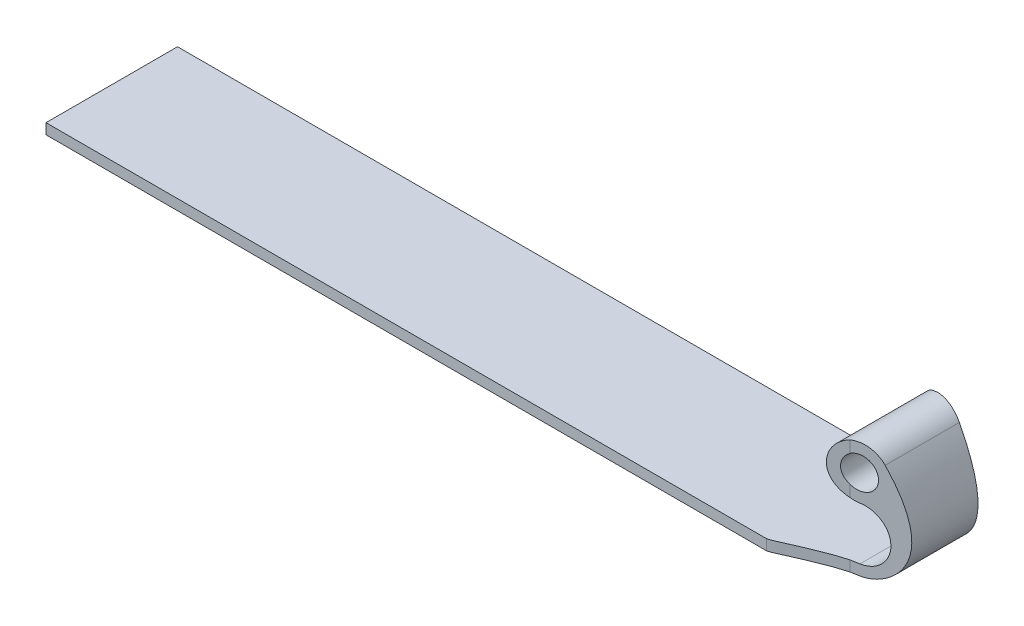
ISO-10303-21;
HEADER;
FILE_DESCRIPTION(('STEP AP214'),'2;1');
FILE_NAME('part.step','',(''),(''),'','','');
FILE_SCHEMA(('AUTOMOTIVE_DESIGN { 1 0 10303 214 1 1 1 1 }'));
ENDSEC;
DATA;
#1=APPLICATION_CONTEXT('core data for automotive mechanical design processes');
#2=APPLICATION_PROTOCOL_DEFINITION('international standard','automotive_design',2000,#1);
#3=PRODUCT_CONTEXT('',#1,'mechanical');
#4=PRODUCT('Part','Part','',(#3));
#5=PRODUCT_RELATED_PRODUCT_CATEGORY('part','',(#4));
#6=PRODUCT_DEFINITION_FORMATION('','',#4);
#7=PRODUCT_DEFINITION_CONTEXT('part definition',#1,'design');
#8=PRODUCT_DEFINITION('design','',#6,#7);
#9=PRODUCT_DEFINITION_SHAPE('','',#8);
#10=(LENGTH_UNIT() NAMED_UNIT(*) SI_UNIT(.MILLI.,.METRE.));
#11=(NAMED_UNIT(*) PLANE_ANGLE_UNIT() SI_UNIT($,.RADIAN.));
#12=(NAMED_UNIT(*) SI_UNIT($,.STERADIAN.) SOLID_ANGLE_UNIT());
#13=UNCERTAINTY_MEASURE_WITH_UNIT(LENGTH_MEASURE(1.E-05),#10,'distance_accuracy_value','');
#14=(GEOMETRIC_REPRESENTATION_CONTEXT(3) GLOBAL_UNCERTAINTY_ASSIGNED_CONTEXT((#13)) GLOBAL_UNIT_ASSIGNED_CONTEXT((#10,
#11,#12)) REPRESENTATION_CONTEXT('',''));
#15=CARTESIAN_POINT('',(0.,0.,0.));
#16=DIRECTION('',(0.,0.,1.));
#17=DIRECTION('',(1.,0.,0.));
#18=AXIS2_PLACEMENT_3D('',#15,#16,#17);
#19=CARTESIAN_POINT('',(-38.1,1.016,-6.35));
#20=DIRECTION('',(0.,0.,1.));
#21=DIRECTION('',(1.,0.,0.));
#22=AXIS2_PLACEMENT_3D('',#19,#20,#21);
#23=PLANE('',#22);
#24=DIRECTION('',(0.,1.,0.));
#25=VECTOR('',#24,1.);
#26=CARTESIAN_POINT('',(31.4618728230442,-8.984,-6.35));
#27=LINE('',#26,#25);
#28=CARTESIAN_POINT('',(31.4618728230442,0.,-6.35));
#29=VERTEX_POINT('',#28);
#30=CARTESIAN_POINT('',(31.4618728230442,1.016,-6.35));
#31=VERTEX_POINT('',#30);
#32=EDGE_CURVE('E217',#29,#31,#27,.T.);
#33=ORIENTED_EDGE('',*,*,#32,.F.);
#34=DIRECTION('',(-1.,0.,0.));
#35=VECTOR('',#34,1.);
#36=CARTESIAN_POINT('',(-38.1,0.,-6.35));
#37=LINE('',#36,#35);
#38=CARTESIAN_POINT('',(-38.1,0.,-6.35));
#39=VERTEX_POINT('',#38);
#40=EDGE_CURVE('E231',#29,#39,#37,.T.);
#41=ORIENTED_EDGE('',*,*,#40,.T.);
#42=DIRECTION('',(0.,-1.,0.));
#43=VECTOR('',#42,1.);
#44=CARTESIAN_POINT('',(-38.1,1.016,-6.35));
#45=LINE('',#44,#43);
#46=CARTESIAN_POINT('',(-38.1,1.016,-6.35));
#47=VERTEX_POINT('',#46);
#48=EDGE_CURVE('E260',#47,#39,#45,.T.);
#49=ORIENTED_EDGE('',*,*,#48,.F.);
#50=DIRECTION('',(-1.,0.,0.));
#51=VECTOR('',#50,1.);
#52=CARTESIAN_POINT('',(-38.1,1.016,-6.35));
#53=LINE('',#52,#51);
#54=EDGE_CURVE('E245',#31,#47,#53,.T.);
#55=ORIENTED_EDGE('',*,*,#54,.F.);
#56=EDGE_LOOP('',(#33,#41,#49,#55));
#57=FACE_BOUND('',#56,.T.);
#58=ADVANCED_FACE('F32',(#57),#23,.F.);
#59=CARTESIAN_POINT('',(0.,1.016,0.));
#60=DIRECTION('',(0.,-1.,0.));
#61=DIRECTION('',(0.,0.,-1.));
#62=AXIS2_PLACEMENT_3D('',#59,#60,#61);
#63=PLANE('',#62);
#64=CARTESIAN_POINT('',(39.2056630331056,1.016,-3.75211753897652));
#65=CARTESIAN_POINT('',(36.3576672367003,1.016,-3.87614198539521));
#66=CARTESIAN_POINT('',(31.9938209662141,1.016,-6.35));
#67=CARTESIAN_POINT('',(31.4618728230442,1.016,-6.35));
#68=B_SPLINE_CURVE_WITH_KNOTS('',3,(#64,#65,#66,#67),.UNSPECIFIED.,.F.,.F.,(4,4),(0.,1.),.UNSPECIFIED.);
#69=CARTESIAN_POINT('',(37.2738999237345,1.016,-4.09273949549593));
#70=VERTEX_POINT('',#69);
#71=EDGE_CURVE('E234',#31,#70,#68,.F.);
#72=ORIENTED_EDGE('',*,*,#71,.F.);
#73=ORIENTED_EDGE('',*,*,#54,.T.);
#74=DIRECTION('',(0.,0.,1.));
#75=VECTOR('',#74,1.);
#76=CARTESIAN_POINT('',(-38.1,1.016,6.35));
#77=LINE('',#76,#75);
#78=CARTESIAN_POINT('',(-38.1,1.016,6.35));
#79=VERTEX_POINT('',#78);
#80=EDGE_CURVE('E248',#47,#79,#77,.T.);
#81=ORIENTED_EDGE('',*,*,#80,.T.);
#82=DIRECTION('',(1.,0.,0.));
#83=VECTOR('',#82,1.);
#84=CARTESIAN_POINT('',(-38.1,1.016,6.35));
#85=LINE('',#84,#83);
#86=CARTESIAN_POINT('',(31.4618728230442,1.016,6.35));
#87=VERTEX_POINT('',#86);
#88=EDGE_CURVE('E250',#79,#87,#85,.T.);
#89=ORIENTED_EDGE('',*,*,#88,.T.);
#90=CARTESIAN_POINT('',(39.2056630331056,1.016,3.75211753897652));
#91=CARTESIAN_POINT('',(36.3576672367003,1.016,3.87614198539521));
#92=CARTESIAN_POINT('',(31.9938209662141,1.016,6.35));
#93=CARTESIAN_POINT('',(31.4618728230442,1.016,6.35));
#94=B_SPLINE_CURVE_WITH_KNOTS('',3,(#90,#91,#92,#93),.UNSPECIFIED.,.F.,.F.,(4,4),(0.,1.),.UNSPECIFIED.);
#95=CARTESIAN_POINT('',(37.2738999237345,1.016,4.09273949549593));
#96=VERTEX_POINT('',#95);
#97=EDGE_CURVE('E149',#87,#96,#94,.F.);
#98=ORIENTED_EDGE('',*,*,#97,.T.);
#99=DIRECTION('',(-0.984807753012208,0.,0.173648177666931));
#100=VECTOR('',#99,1.);
#101=CARTESIAN_POINT('',(1.82384528316646,1.016,10.3435405962174));
#102=LINE('',#101,#100);
#103=CARTESIAN_POINT('',(38.1,1.016,3.94707576328499));
#104=VERTEX_POINT('',#103);
#105=EDGE_CURVE('E156',#104,#96,#102,.T.);
#106=ORIENTED_EDGE('',*,*,#105,.F.);
#107=DIRECTION('',(0.,0.,-1.));
#108=VECTOR('',#107,1.);
#109=CARTESIAN_POINT('',(38.1,1.016,6.35));
#110=LINE('',#109,#108);
#111=CARTESIAN_POINT('',(38.1,1.016,-3.94707576328499));
#112=VERTEX_POINT('',#111);
#113=EDGE_CURVE('E242',#104,#112,#110,.T.);
#114=ORIENTED_EDGE('',*,*,#113,.T.);
#115=DIRECTION('',(-0.984807753012208,0.,-0.173648177666931));
#116=VECTOR('',#115,1.);
#117=CARTESIAN_POINT('',(1.82384528316646,1.016,-10.3435405962174));
#118=LINE('',#117,#116);
#119=EDGE_CURVE('E289',#112,#70,#118,.T.);
#120=ORIENTED_EDGE('',*,*,#119,.T.);
#121=EDGE_LOOP('',(#72,#73,#81,#89,#98,#106,#114,#120));
#122=FACE_BOUND('',#121,.T.);
#123=ADVANCED_FACE('F300',(#122),#63,.F.);
#124=CARTESIAN_POINT('',(0.,0.,0.));
#125=DIRECTION('',(0.,-1.,0.));
#126=DIRECTION('',(0.,0.,-1.));
#127=AXIS2_PLACEMENT_3D('',#124,#125,#126);
#128=PLANE('',#127);
#129=ORIENTED_EDGE('',*,*,#40,.F.);
#130=CARTESIAN_POINT('',(39.2056630331056,0.,-3.75211753897652));
#131=CARTESIAN_POINT('',(36.3576672367003,0.,-3.87614198539521));
#132=CARTESIAN_POINT('',(31.9938209662141,0.,-6.35));
#133=CARTESIAN_POINT('',(31.4618728230442,0.,-6.35));
#134=B_SPLINE_CURVE_WITH_KNOTS('',3,(#130,#131,#132,#133),.UNSPECIFIED.,.F.,.F.,(4,4),(0.,1.),.UNSPECIFIED.);
#135=CARTESIAN_POINT('',(37.2738999237345,0.,-4.09273949549593));
#136=VERTEX_POINT('',#135);
#137=EDGE_CURVE('E315',#29,#136,#134,.F.);
#138=ORIENTED_EDGE('',*,*,#137,.T.);
#139=DIRECTION('',(-0.984807753012208,0.,-0.173648177666931));
#140=VECTOR('',#139,1.);
#141=CARTESIAN_POINT('',(1.82384528316646,0.,-10.3435405962174));
#142=LINE('',#141,#140);
#143=CARTESIAN_POINT('',(38.1,0.,-3.94707576328499));
#144=VERTEX_POINT('',#143);
#145=EDGE_CURVE('E287',#144,#136,#142,.T.);
#146=ORIENTED_EDGE('',*,*,#145,.F.);
#147=DIRECTION('',(0.,0.,-1.));
#148=VECTOR('',#147,1.);
#149=CARTESIAN_POINT('',(38.1,0.,6.35));
#150=LINE('',#149,#148);
#151=CARTESIAN_POINT('',(38.1,0.,3.94707576328499));
#152=VERTEX_POINT('',#151);
#153=EDGE_CURVE('E164',#152,#144,#150,.T.);
#154=ORIENTED_EDGE('',*,*,#153,.F.);
#155=DIRECTION('',(-0.984807753012208,0.,0.173648177666931));
#156=VECTOR('',#155,1.);
#157=CARTESIAN_POINT('',(1.82384528316646,0.,10.3435405962174));
#158=LINE('',#157,#156);
#159=CARTESIAN_POINT('',(37.2738999237345,0.,4.09273949549593));
#160=VERTEX_POINT('',#159);
#161=EDGE_CURVE('E153',#152,#160,#158,.T.);
#162=ORIENTED_EDGE('',*,*,#161,.T.);
#163=CARTESIAN_POINT('',(39.2056630331056,0.,3.75211753897652));
#164=CARTESIAN_POINT('',(36.3576672367003,0.,3.87614198539521));
#165=CARTESIAN_POINT('',(31.9938209662141,0.,6.35));
#166=CARTESIAN_POINT('',(31.4618728230442,0.,6.35));
#167=B_SPLINE_CURVE_WITH_KNOTS('',3,(#163,#164,#165,#166),.UNSPECIFIED.,.F.,.F.,(4,4),(0.,1.),.UNSPECIFIED.);
#168=CARTESIAN_POINT('',(31.4618728230442,0.,6.35));
#169=VERTEX_POINT('',#168);
#170=EDGE_CURVE('E138',#169,#160,#167,.F.);
#171=ORIENTED_EDGE('',*,*,#170,.F.);
#172=DIRECTION('',(1.,0.,0.));
#173=VECTOR('',#172,1.);
#174=CARTESIAN_POINT('',(-38.1,0.,6.35));
#175=LINE('',#174,#173);
#176=CARTESIAN_POINT('',(-38.1,0.,6.35));
#177=VERTEX_POINT('',#176);
#178=EDGE_CURVE('E246',#177,#169,#175,.T.);
#179=ORIENTED_EDGE('',*,*,#178,.F.);
#180=DIRECTION('',(0.,0.,1.));
#181=VECTOR('',#180,1.);
#182=CARTESIAN_POINT('',(-38.1,0.,6.35));
#183=LINE('',#182,#181);
#184=EDGE_CURVE('E255',#39,#177,#183,.T.);
#185=ORIENTED_EDGE('',*,*,#184,.F.);
#186=EDGE_LOOP('',(#129,#138,#146,#154,#162,#171,#179,#185));
#187=FACE_BOUND('',#186,.T.);
#188=ADVANCED_FACE('F161',(#187),#128,.T.);
#189=CARTESIAN_POINT('',(38.1,3.556,6.35));
#190=DIRECTION('',(0.,0.,-1.));
#191=DIRECTION('',(-1.,0.,0.));
#192=AXIS2_PLACEMENT_3D('',#189,#190,#191);
#193=CYLINDRICAL_SURFACE('',#192,2.54);
#194=CARTESIAN_POINT('',(38.1,3.556,-3.94707576328499));
#195=DIRECTION('',(-0.173648177666931,0.,0.984807753012208));
#196=DIRECTION('',(-0.984807753012208,0.,-0.173648177666931));
#197=AXIS2_PLACEMENT_3D('',#194,#195,#196);
#198=ELLIPSE('',#197,2.57918359418979,2.54);
#199=CARTESIAN_POINT('',(38.1,6.096,-3.94707576328499));
#200=VERTEX_POINT('',#199);
#201=EDGE_CURVE('E60',#112,#200,#198,.T.);
#202=ORIENTED_EDGE('',*,*,#201,.F.);
#203=ORIENTED_EDGE('',*,*,#113,.F.);
#204=CARTESIAN_POINT('',(38.1,3.556,3.94707576328499));
#205=DIRECTION('',(0.173648177666931,0.,0.984807753012208));
#206=DIRECTION('',(0.984807753012208,0.,-0.173648177666931));
#207=AXIS2_PLACEMENT_3D('',#204,#205,#206);
#208=ELLIPSE('',#207,2.57918359418979,2.54);
#209=CARTESIAN_POINT('',(38.1,6.096,3.94707576328499));
#210=VERTEX_POINT('',#209);
#211=EDGE_CURVE('E216',#104,#210,#208,.T.);
#212=ORIENTED_EDGE('',*,*,#211,.T.);
#213=DIRECTION('',(0.,0.,-1.));
#214=VECTOR('',#213,1.);
#215=CARTESIAN_POINT('',(38.1,6.096,6.35));
#216=LINE('',#215,#214);
#217=EDGE_CURVE('E229',#210,#200,#216,.T.);
#218=ORIENTED_EDGE('',*,*,#217,.T.);
#219=EDGE_LOOP('',(#202,#203,#212,#218));
#220=FACE_BOUND('',#219,.T.);
#221=ADVANCED_FACE('F278',(#220),#193,.F.);
#222=CARTESIAN_POINT('',(40.16864649384,10.1098730215061,6.35));
#223=CARTESIAN_POINT('',(43.8111052533142,4.99751976461316,6.35));
#224=CARTESIAN_POINT('',(42.8225920973942,1.81527670168074,6.35));
#225=CARTESIAN_POINT('',(40.0156055783276,0.,6.35));
#226=CARTESIAN_POINT('',(38.1,0.,6.35));
#227=B_SPLINE_CURVE_WITH_KNOTS('',4,(#222,#223,#224,#225,#226),.UNSPECIFIED.,.F.,.F.,(5,5),(0.,
1.),.UNSPECIFIED.);
#228=DIRECTION('',(0.,0.,-1.));
#229=VECTOR('',#228,1.);
#230=SURFACE_OF_LINEAR_EXTRUSION('',#227,#229);
#231=CARTESIAN_POINT('',(40.16864649384,10.1098730215061,-3.58231757287303));
#232=CARTESIAN_POINT('',(40.2386971006965,10.0115503921679,-3.56996576086924));
#233=CARTESIAN_POINT('',(40.3078609482853,9.91257827008157,-3.55777030844972));
#234=CARTESIAN_POINT('',(40.4442630934014,9.71326212595249,-3.53371893003924));
#235=CARTESIAN_POINT('',(40.5115012098462,9.61291797619587,-3.52186303597801));
#236=CARTESIAN_POINT('',(40.7111666601818,9.30808598208403,-3.48665662996853));
#237=CARTESIAN_POINT('',(40.8403888691159,9.10141147482652,-3.46387126802671));
#238=CARTESIAN_POINT('',(41.0890503345616,8.68117261554222,-3.42002554260613));
#239=CARTESIAN_POINT('',(41.208457601893,8.46758866890948,-3.39897081968292));
#240=CARTESIAN_POINT('',(41.4380547901414,8.02771259792472,-3.35848664069993));
#241=CARTESIAN_POINT('',(41.5478984433418,7.80123237548273,-3.33911824098112));
#242=CARTESIAN_POINT('',(41.7513317726157,7.34151988880115,-3.30324745625479));
#243=CARTESIAN_POINT('',(41.8449634162293,7.10830693851338,-3.28673767123763));
#244=CARTESIAN_POINT('',(42.0124615263438,6.63506163253428,-3.25720323520675));
#245=CARTESIAN_POINT('',(42.0863692722308,6.39504470073996,-3.24417130552353));
#246=CARTESIAN_POINT('',(42.1834881559347,6.01322148353508,-3.22704662599025));
#247=CARTESIAN_POINT('',(42.214837002818,5.87353251454589,-3.22151897847063));
#248=CARTESIAN_POINT('',(42.268744804046,5.59236639544677,-3.21201357864346));
#249=CARTESIAN_POINT('',(42.2913024294141,5.45088897831049,-3.20803606067036));
#250=CARTESIAN_POINT('',(42.3265239314003,5.16737668776498,-3.2018255595691));
#251=CARTESIAN_POINT('',(42.3392372188921,5.02534824220722,-3.1995838639708));
#252=CARTESIAN_POINT('',(42.3539660243098,4.74070139310319,-3.19698677818204));
#253=CARTESIAN_POINT('',(42.3559819118455,4.59808301011045,-3.19663132281944));
#254=CARTESIAN_POINT('',(42.3483476308648,4.31128963571942,-3.19797745253463));
#255=CARTESIAN_POINT('',(42.3385457206322,4.16711846367507,-3.19970579377113));
#256=CARTESIAN_POINT('',(42.3062410942784,3.8802275806142,-3.20540197099901));
#257=CARTESIAN_POINT('',(42.2837384622386,3.73750785999512,-3.20936979216457));
#258=CARTESIAN_POINT('',(42.225531581333,3.45482101833737,-3.21963323573112));
#259=CARTESIAN_POINT('',(42.1898244755356,3.31485449989116,-3.22592936188622));
#260=CARTESIAN_POINT('',(42.1050855085221,3.03914255532555,-3.24087112808807));
#261=CARTESIAN_POINT('',(42.0560550300351,2.90339669280546,-3.24951652432237));
#262=CARTESIAN_POINT('',(41.9502786701516,2.65026019481218,-3.26816775049095));
#263=CARTESIAN_POINT('',(41.8947203608108,2.53235626387664,-3.27796417943029));
#264=CARTESIAN_POINT('',(41.7734191712382,2.30208880756606,-3.29935285194397));
#265=CARTESIAN_POINT('',(41.707676828551,2.18972499017927,-3.31094500073471));
#266=CARTESIAN_POINT('',(41.566685084056,1.97137411142382,-3.33580564934632));
#267=CARTESIAN_POINT('',(41.4914384791459,1.86538518755328,-3.34907365599869));
#268=CARTESIAN_POINT('',(41.3322338568475,1.66042604215021,-3.3771457263634));
#269=CARTESIAN_POINT('',(41.2482757826258,1.56145586641487,-3.391949800097));
#270=CARTESIAN_POINT('',(40.9925669877352,1.28452862680677,-3.43703815984066));
#271=CARTESIAN_POINT('',(40.8103039867785,1.11642238418552,-3.46917604449422));
#272=CARTESIAN_POINT('',(40.4221689147632,0.810059085235462,-3.53761472984975));
#273=CARTESIAN_POINT('',(40.2162333871074,0.671885262989268,-3.57392671966189));
#274=CARTESIAN_POINT('',(39.8837728112507,0.484105947700569,-3.63254848920731));
#275=CARTESIAN_POINT('',(39.7635600730315,0.42274220741561,-3.6537452383802));
#276=CARTESIAN_POINT('',(39.5182703423196,0.310716955437027,-3.69699643599541));
#277=CARTESIAN_POINT('',(39.3931909409632,0.260060825604466,-3.71905130918541));
#278=CARTESIAN_POINT('',(39.1396623463231,0.170855435873748,-3.76375524080156));
#279=CARTESIAN_POINT('',(39.0112351362557,0.132241935880676,-3.78640042299356));
#280=CARTESIAN_POINT('',(38.751268374278,0.0684318092392878,-3.83223957721764));
#281=CARTESIAN_POINT('',(38.6197333219364,0.0432168946400924,-3.85543275585438));
#282=CARTESIAN_POINT('',(38.4230399510609,0.0176186520217874,-3.89011510406622));
#283=CARTESIAN_POINT('',(38.3586323474542,0.0111354913284841,-3.90147190234486));
#284=CARTESIAN_POINT('',(38.2294969968974,0.00233240004275009,-3.92424194881126));
#285=CARTESIAN_POINT('',(38.1647690439846,1.56345411210961E-05,-3.93565523331582));
#286=CARTESIAN_POINT('',(38.1,0.,-3.947075763285));
#287=B_SPLINE_CURVE_WITH_KNOTS('',3,(#231,#232,#233,#234,#235,#236,#237,#238,#239,#240,#241,
#242,#243,#244,#245,#246,#247,#248,#249,#250,#251,#252,#253,#254,#255,#256,#257,#258,#259,#260,
#261,#262,#263,#264,#265,#266,#267,#268,#269,#270,#271,#272,#273,#274,#275,#276,#277,#278,#279,
#280,#281,#282,#283,#284,#285,#286),.UNSPECIFIED.,.F.,.F.,(4,2,2,2,2,2,2,2,2,2,2,2,2,2,2,2,2,2,
2,2,2,2,2,2,2,2,2,4),(0.,0.364054419826309,0.728142961171223,1.46230043845645,2.19876293670766,
2.95559414113654,3.71043587607158,4.46368521761982,4.89325492985614,5.32288955535543,
5.7503535162043,6.17780270749931,6.61079933833974,7.04379310268497,7.4768806048057,
7.90992317730252,8.30151945164267,8.69309506336898,9.08455571022149,9.47601891111124,
10.2228279662134,10.9716877737666,11.381136446,11.790790428605,12.1982202246698,
12.6050924752566,12.8021412284295,12.9993396107504),.UNSPECIFIED.);
#288=CARTESIAN_POINT('',(40.16864649384,10.1098730215061,-3.58231757287303));
#289=VERTEX_POINT('',#288);
#290=EDGE_CURVE('E227',#289,#144,#287,.T.);
#291=ORIENTED_EDGE('',*,*,#290,.F.);
#292=DIRECTION('',(0.,0.,-1.));
#293=VECTOR('',#292,1.);
#294=CARTESIAN_POINT('',(40.16864649384,10.1098730215061,6.35));
#295=LINE('',#294,#293);
#296=CARTESIAN_POINT('',(40.16864649384,10.1098730215061,3.58231757287303));
#297=VERTEX_POINT('',#296);
#298=EDGE_CURVE('E224',#297,#289,#295,.T.);
#299=ORIENTED_EDGE('',*,*,#298,.F.);
#300=CARTESIAN_POINT('',(40.16864649384,10.1098730215061,3.58231757287303));
#301=CARTESIAN_POINT('',(40.2386971006964,10.0115503921679,3.56996576086924));
#302=CARTESIAN_POINT('',(40.3078609482853,9.91257827008156,3.55777030844972));
#303=CARTESIAN_POINT('',(40.4442630934014,9.71326212595249,3.53371893003924));
#304=CARTESIAN_POINT('',(40.5115012098462,9.61291797619587,3.521863035978));
#305=CARTESIAN_POINT('',(40.7111666601818,9.30808598208404,3.48665662996853));
#306=CARTESIAN_POINT('',(40.8403888691159,9.10141147482651,3.46387126802671));
#307=CARTESIAN_POINT('',(41.0890503345615,8.68117261554222,3.42002554260613));
#308=CARTESIAN_POINT('',(41.208457601893,8.46758866890949,3.39897081968292));
#309=CARTESIAN_POINT('',(41.4380547901414,8.02771259792473,3.35848664069993));
#310=CARTESIAN_POINT('',(41.5478984433418,7.80123237548274,3.33911824098112));
#311=CARTESIAN_POINT('',(41.7513317726156,7.34151988880116,3.30324745625479));
#312=CARTESIAN_POINT('',(41.8449634162293,7.10830693851339,3.28673767123762));
#313=CARTESIAN_POINT('',(42.0124615263438,6.63506163253429,3.25720323520675));
#314=CARTESIAN_POINT('',(42.0863692722308,6.39504470073996,3.24417130552353));
#315=CARTESIAN_POINT('',(42.1834881559347,6.01322148353508,3.22704662599025));
#316=CARTESIAN_POINT('',(42.214837002818,5.87353251454589,3.22151897847062));
#317=CARTESIAN_POINT('',(42.268744804046,5.59236639544677,3.21201357864346));
#318=CARTESIAN_POINT('',(42.2913024294141,5.45088897831049,3.20803606067036));
#319=CARTESIAN_POINT('',(42.3265239314003,5.16737668776498,3.2018255595691));
#320=CARTESIAN_POINT('',(42.3392372188921,5.02534824220722,3.1995838639708));
#321=CARTESIAN_POINT('',(42.3539660243098,4.74070139310319,3.19698677818204));
#322=CARTESIAN_POINT('',(42.3559819118455,4.59808301011044,3.19663132281943));
#323=CARTESIAN_POINT('',(42.3483476308648,4.31128963571942,3.19797745253463));
#324=CARTESIAN_POINT('',(42.3385457206322,4.16711846367507,3.19970579377113));
#325=CARTESIAN_POINT('',(42.3062410942784,3.88022758061419,3.20540197099902));
#326=CARTESIAN_POINT('',(42.2837384622386,3.73750785999512,3.20936979216458));
#327=CARTESIAN_POINT('',(42.225531581333,3.45482101833736,3.21963323573112));
#328=CARTESIAN_POINT('',(42.1898244755356,3.31485449989114,3.22592936188622));
#329=CARTESIAN_POINT('',(42.1050855085221,3.03914255532555,3.24087112808806));
#330=CARTESIAN_POINT('',(42.0560550300351,2.90339669280546,3.24951652432237));
#331=CARTESIAN_POINT('',(41.9502786701516,2.65026019481218,3.26816775049096));
#332=CARTESIAN_POINT('',(41.8947203608108,2.53235626387663,3.27796417943029));
#333=CARTESIAN_POINT('',(41.7734191712382,2.30208880756605,3.29935285194397));
#334=CARTESIAN_POINT('',(41.707676828551,2.18972499017926,3.31094500073471));
#335=CARTESIAN_POINT('',(41.566685084056,1.97137411142381,3.33580564934632));
#336=CARTESIAN_POINT('',(41.4914384791459,1.86538518755327,3.34907365599869));
#337=CARTESIAN_POINT('',(41.3322338568474,1.6604260421502,3.37714572636341));
#338=CARTESIAN_POINT('',(41.2482757826258,1.56145586641486,3.39194980009701));
#339=CARTESIAN_POINT('',(40.9925669877352,1.28452862680677,3.43703815984066));
#340=CARTESIAN_POINT('',(40.8103039867785,1.11642238418552,3.46917604449422));
#341=CARTESIAN_POINT('',(40.4221689147632,0.810059085235468,3.53761472984975));
#342=CARTESIAN_POINT('',(40.2162333871074,0.671885262989276,3.57392671966189));
#343=CARTESIAN_POINT('',(39.8837728112507,0.484105947700578,3.6325484892073));
#344=CARTESIAN_POINT('',(39.7635600730315,0.422742207415618,3.6537452383802));
#345=CARTESIAN_POINT('',(39.5182703423196,0.310716955437034,3.69699643599541));
#346=CARTESIAN_POINT('',(39.3931909409632,0.260060825604473,3.71905130918541));
#347=CARTESIAN_POINT('',(39.1396623463231,0.170855435873755,3.76375524080155));
#348=CARTESIAN_POINT('',(39.0112351362557,0.13224193588068,3.78640042299355));
#349=CARTESIAN_POINT('',(38.7512683742781,0.0684318092392889,3.83223957721763));
#350=CARTESIAN_POINT('',(38.6197333219364,0.043216894640093,3.85543275585438));
#351=CARTESIAN_POINT('',(38.4230399510609,0.0176186520217876,3.89011510406622));
#352=CARTESIAN_POINT('',(38.3586323474542,0.0111354913284841,3.90147190234486));
#353=CARTESIAN_POINT('',(38.2294969968974,0.0023324000427504,3.92424194881125));
#354=CARTESIAN_POINT('',(38.1647690439846,1.56345411215077E-05,3.93565523331582));
#355=CARTESIAN_POINT('',(38.1,0.,3.94707576328499));
#356=B_SPLINE_CURVE_WITH_KNOTS('',3,(#300,#301,#302,#303,#304,#305,#306,#307,#308,#309,#310,
#311,#312,#313,#314,#315,#316,#317,#318,#319,#320,#321,#322,#323,#324,#325,#326,#327,#328,#329,
#330,#331,#332,#333,#334,#335,#336,#337,#338,#339,#340,#341,#342,#343,#344,#345,#346,#347,#348,
#349,#350,#351,#352,#353,#354,#355),.UNSPECIFIED.,.F.,.F.,(4,2,2,2,2,2,2,2,2,2,2,2,2,2,2,2,2,2,
2,2,2,2,2,2,2,2,2,4),(0.,0.364054419826313,0.728142961171225,1.46230043845645,2.19876293670765,
2.95559414113653,3.71043587607157,4.46368521761982,4.89325492985614,5.32288955535543,
5.7503535162043,6.17780270749931,6.61079933833975,7.04379310268498,7.47688060480571,
7.90992317730253,8.30151945164268,8.69309506336899,9.08455571022151,9.47601891111125,
10.2228279662134,10.9716877737666,11.381136446,11.790790428605,12.1982202246698,
12.6050924752566,12.8021412284295,12.9993396107504),.UNSPECIFIED.);
#357=EDGE_CURVE('E165',#297,#152,#356,.T.);
#358=ORIENTED_EDGE('',*,*,#357,.T.);
#359=ORIENTED_EDGE('',*,*,#153,.T.);
#360=EDGE_LOOP('',(#291,#299,#358,#359));
#361=FACE_BOUND('',#360,.T.);
#362=ADVANCED_FACE('F226',(#361),#230,.T.);
#363=CARTESIAN_POINT('',(38.1,8.636,6.35));
#364=DIRECTION('',(0.,0.,-1.));
#365=DIRECTION('',(-1.,0.,0.));
#366=AXIS2_PLACEMENT_3D('',#363,#364,#365);
#367=CYLINDRICAL_SURFACE('',#366,2.54);
#368=CARTESIAN_POINT('',(38.1,8.636,-3.94707576328499));
#369=DIRECTION('',(-0.173648177666931,0.,0.984807753012208));
#370=DIRECTION('',(-0.984807753012208,0.,-0.173648177666931));
#371=AXIS2_PLACEMENT_3D('',#368,#369,#370);
#372=ELLIPSE('',#371,2.57918359418979,2.54);
#373=CARTESIAN_POINT('',(37.2738999237345,11.0379072971274,-4.09273949549593));
#374=VERTEX_POINT('',#373);
#375=EDGE_CURVE('E288',#374,#289,#372,.F.);
#376=ORIENTED_EDGE('',*,*,#375,.F.);
#377=CARTESIAN_POINT('',(37.2738999403494,11.0379073028419,-4.09273949091969));
#378=CARTESIAN_POINT('',(37.2045037892503,11.0140353486144,-4.11185431943039));
#379=CARTESIAN_POINT('',(37.1362390354365,10.9871958840568,-4.13121851050796));
#380=CARTESIAN_POINT('',(37.0023326205583,10.9277464139611,-4.17016070501194));
#381=CARTESIAN_POINT('',(36.9366909849326,10.8951363524768,-4.18973871050955));
#382=CARTESIAN_POINT('',(36.7441998517194,10.7888738479148,-4.24837871048672));
#383=CARTESIAN_POINT('',(36.6218315149095,10.7068054389988,-4.28733338510817));
#384=CARTESIAN_POINT('',(36.3925505212813,10.5222437445872,-4.36254198524669));
#385=CARTESIAN_POINT('',(36.2856506347464,10.4197337472847,-4.39879366742324));
#386=CARTESIAN_POINT('',(36.0906717447484,10.196797535508,-4.46632338227667));
#387=CARTESIAN_POINT('',(36.0025791043773,10.0763844105873,-4.49760501443804));
#388=CARTESIAN_POINT('',(35.8504137181982,9.82429306776502,-4.55240211630605));
#389=CARTESIAN_POINT('',(35.7857476396444,9.6930151481335,-4.57610731136554));
#390=CARTESIAN_POINT('',(35.6796662921259,9.42020585252147,-4.61530793316967));
#391=CARTESIAN_POINT('',(35.6382455967444,9.27867687827078,-4.63080527591289));
#392=CARTESIAN_POINT('',(35.5822272585922,8.99870278289426,-4.65182838564265));
#393=CARTESIAN_POINT('',(35.5661515368078,8.86059357526938,-4.65790326804556));
#394=CARTESIAN_POINT('',(35.5567647892007,8.58351503700823,-4.66144606444535));
#395=CARTESIAN_POINT('',(35.5634472115514,8.44454596541583,-4.65891645558359));
#396=CARTESIAN_POINT('',(35.5986704959378,8.1746422397811,-4.64565341053266));
#397=CARTESIAN_POINT('',(35.6264632702475,8.04359488685331,-4.6352007685831));
#398=CARTESIAN_POINT('',(35.7019632017812,7.78820673732337,-4.60705791941003));
#399=CARTESIAN_POINT('',(35.7496709072729,7.6638661254675,-4.58936751292762));
#400=CARTESIAN_POINT('',(35.8644096102553,7.42278523607515,-4.54737363223449));
#401=CARTESIAN_POINT('',(35.9317818239571,7.30622816426661,-4.52295384934066));
#402=CARTESIAN_POINT('',(36.0833751814713,7.08592997881478,-4.46899751238524));
#403=CARTESIAN_POINT('',(36.1676044223746,6.98219506304033,-4.43945850027479));
#404=CARTESIAN_POINT('',(36.3556839412402,6.7843452808789,-4.37505473041564));
#405=CARTESIAN_POINT('',(36.4603669051504,6.69109039644563,-4.3399847517229));
#406=CARTESIAN_POINT('',(36.6830952149677,6.5233270439492,-4.26780169032599));
#407=CARTESIAN_POINT('',(36.8011295936715,6.44880334942886,-4.23069029718338));
#408=CARTESIAN_POINT('',(36.9806433655096,6.35505991758673,-4.17664066839133));
#409=CARTESIAN_POINT('',(37.0380352863863,6.327781404543,-4.15968912283526));
#410=CARTESIAN_POINT('',(37.1546380924911,6.27763099036508,-4.12600946208422));
#411=CARTESIAN_POINT('',(37.2138453127007,6.25475081133886,-4.10928098342607));
#412=CARTESIAN_POINT('',(37.2738999403494,6.23409269715811,-4.09273949091969));
#413=B_SPLINE_CURVE_WITH_KNOTS('',3,(#377,#378,#379,#380,#381,#382,#383,#384,#385,#386,#387,
#388,#389,#390,#391,#392,#393,#394,#395,#396,#397,#398,#399,#400,#401,#402,#403,#404,#405,#406,
#407,#408,#409,#410,#411,#412),.UNSPECIFIED.,.F.,.F.,(4,2,2,2,2,2,2,2,2,2,2,2,2,2,2,2,2,4),(0.,
0.227365254410789,0.454732713253839,0.909621286429405,1.36488328502632,1.81981404898019,
2.26224831484584,2.70457925557381,3.12000927102645,3.53531969872645,3.9365621391007,
4.33781562660353,4.74649374957276,5.15536864986083,5.58706243469513,6.01840415530432,
6.21556037994106,6.41234183341763),.UNSPECIFIED.);
#414=CARTESIAN_POINT('',(37.2738999237345,6.23409270287255,-4.09273949549593));
#415=VERTEX_POINT('',#414);
#416=EDGE_CURVE('E325',#374,#415,#413,.T.);
#417=ORIENTED_EDGE('',*,*,#416,.T.);
#418=EDGE_CURVE('E350',#200,#415,#372,.F.);
#419=ORIENTED_EDGE('',*,*,#418,.F.);
#420=ORIENTED_EDGE('',*,*,#217,.F.);
#421=CARTESIAN_POINT('',(38.1,8.636,3.94707576328499));
#422=DIRECTION('',(0.173648177666931,0.,0.984807753012208));
#423=DIRECTION('',(0.984807753012208,0.,-0.173648177666931));
#424=AXIS2_PLACEMENT_3D('',#421,#422,#423);
#425=ELLIPSE('',#424,2.57918359418979,2.54);
#426=CARTESIAN_POINT('',(37.2738999237345,6.23409270287256,4.09273949549593));
#427=VERTEX_POINT('',#426);
#428=EDGE_CURVE('E213',#210,#427,#425,.F.);
#429=ORIENTED_EDGE('',*,*,#428,.T.);
#430=CARTESIAN_POINT('',(37.2738999403494,11.0379073028419,4.09273949091969));
#431=CARTESIAN_POINT('',(37.2045037892503,11.0140353486144,4.11185431943039));
#432=CARTESIAN_POINT('',(37.1362390354365,10.9871958840568,4.13121851050797));
#433=CARTESIAN_POINT('',(37.0023326205583,10.9277464139611,4.17016070501194));
#434=CARTESIAN_POINT('',(36.9366909849326,10.8951363524767,4.18973871050955));
#435=CARTESIAN_POINT('',(36.7441998517194,10.7888738479148,4.24837871048672));
#436=CARTESIAN_POINT('',(36.6218315149095,10.7068054389988,4.28733338510817));
#437=CARTESIAN_POINT('',(36.3925505212813,10.5222437445872,4.36254198524669));
#438=CARTESIAN_POINT('',(36.2856506347463,10.4197337472847,4.39879366742324));
#439=CARTESIAN_POINT('',(36.0906717447484,10.1967975355079,4.46632338227667));
#440=CARTESIAN_POINT('',(36.0025791043773,10.0763844105873,4.49760501443804));
#441=CARTESIAN_POINT('',(35.8504137181982,9.824293067765,4.55240211630605));
#442=CARTESIAN_POINT('',(35.7857476396444,9.69301514813348,4.57610731136554));
#443=CARTESIAN_POINT('',(35.6796662921259,9.42020585252145,4.61530793316967));
#444=CARTESIAN_POINT('',(35.6382455967444,9.27867687827077,4.6308052759129));
#445=CARTESIAN_POINT('',(35.5822272585922,8.99870278289425,4.65182838564266));
#446=CARTESIAN_POINT('',(35.5661515368078,8.86059357526937,4.65790326804557));
#447=CARTESIAN_POINT('',(35.5567647892007,8.58351503700821,4.66144606444535));
#448=CARTESIAN_POINT('',(35.5634472115514,8.44454596541582,4.65891645558359));
#449=CARTESIAN_POINT('',(35.5986704959378,8.17464223978108,4.64565341053266));
#450=CARTESIAN_POINT('',(35.6264632702475,8.04359488685329,4.6352007685831));
#451=CARTESIAN_POINT('',(35.7019632017812,7.78820673732336,4.60705791941003));
#452=CARTESIAN_POINT('',(35.7496709072729,7.66386612546749,4.5893675129276));
#453=CARTESIAN_POINT('',(35.8644096102553,7.42278523607514,4.54737363223447));
#454=CARTESIAN_POINT('',(35.9317818239571,7.30622816426659,4.52295384934065));
#455=CARTESIAN_POINT('',(36.0833751814714,7.08592997881476,4.46899751238523));
#456=CARTESIAN_POINT('',(36.1676044223747,6.98219506304031,4.43945850027479));
#457=CARTESIAN_POINT('',(36.3556839412402,6.78434528087888,4.37505473041563));
#458=CARTESIAN_POINT('',(36.4603669051504,6.69109039644561,4.33998475172289));
#459=CARTESIAN_POINT('',(36.6830952149678,6.52332704394919,4.26780169032598));
#460=CARTESIAN_POINT('',(36.8011295936716,6.44880334942887,4.23069029718337));
#461=CARTESIAN_POINT('',(36.9806433655096,6.35505991758673,4.17664066839133));
#462=CARTESIAN_POINT('',(37.0380352863863,6.327781404543,4.15968912283525));
#463=CARTESIAN_POINT('',(37.1546380924911,6.27763099036507,4.12600946208422));
#464=CARTESIAN_POINT('',(37.2138453127007,6.25475081133886,4.10928098342607));
#465=CARTESIAN_POINT('',(37.2738999403494,6.23409269715811,4.0927394909197));
#466=B_SPLINE_CURVE_WITH_KNOTS('',3,(#430,#431,#432,#433,#434,#435,#436,#437,#438,#439,#440,
#441,#442,#443,#444,#445,#446,#447,#448,#449,#450,#451,#452,#453,#454,#455,#456,#457,#458,#459,
#460,#461,#462,#463,#464,#465),.UNSPECIFIED.,.F.,.F.,(4,2,2,2,2,2,2,2,2,2,2,2,2,2,2,2,2,4),(0.,
0.227365254410803,0.454732713253855,0.90962128642941,1.36488328502633,1.8198140489802,
2.26224831484585,2.70457925557383,3.12000927102646,3.53531969872646,3.93656213910072,
4.33781562660355,4.74649374957278,5.15536864986085,5.58706243469515,6.01840415530434,
6.21556037994106,6.41234183341761),.UNSPECIFIED.);
#467=CARTESIAN_POINT('',(37.2738999237345,11.0379072971274,4.09273949549593));
#468=VERTEX_POINT('',#467);
#469=EDGE_CURVE('E150',#468,#427,#466,.T.);
#470=ORIENTED_EDGE('',*,*,#469,.F.);
#471=EDGE_CURVE('E168',#468,#297,#425,.F.);
#472=ORIENTED_EDGE('',*,*,#471,.T.);
#473=ORIENTED_EDGE('',*,*,#298,.T.);
#474=EDGE_LOOP('',(#376,#417,#419,#420,#429,#470,#472,#473));
#475=FACE_BOUND('',#474,.T.);
#476=ADVANCED_FACE('F186',(#475),#367,.T.);
#477=CARTESIAN_POINT('',(-38.1,1.016,6.35));
#478=DIRECTION('',(1.,0.,0.));
#479=DIRECTION('',(0.,0.,-1.));
#480=AXIS2_PLACEMENT_3D('',#477,#478,#479);
#481=PLANE('',#480);
#482=ORIENTED_EDGE('',*,*,#184,.T.);
#483=DIRECTION('',(0.,-1.,0.));
#484=VECTOR('',#483,1.);
#485=CARTESIAN_POINT('',(-38.1,1.016,6.35));
#486=LINE('',#485,#484);
#487=EDGE_CURVE('E252',#79,#177,#486,.T.);
#488=ORIENTED_EDGE('',*,*,#487,.F.);
#489=ORIENTED_EDGE('',*,*,#80,.F.);
#490=ORIENTED_EDGE('',*,*,#48,.T.);
#491=EDGE_LOOP('',(#482,#488,#489,#490));
#492=FACE_BOUND('',#491,.T.);
#493=ADVANCED_FACE('F318',(#492),#481,.F.);
#494=CARTESIAN_POINT('',(-38.1,1.016,6.35));
#495=DIRECTION('',(0.,0.,-1.));
#496=DIRECTION('',(-1.,0.,0.));
#497=AXIS2_PLACEMENT_3D('',#494,#495,#496);
#498=PLANE('',#497);
#499=ORIENTED_EDGE('',*,*,#178,.T.);
#500=DIRECTION('',(0.,1.,0.));
#501=VECTOR('',#500,1.);
#502=CARTESIAN_POINT('',(31.4618728230442,-8.984,6.35));
#503=LINE('',#502,#501);
#504=EDGE_CURVE('E144',#169,#87,#503,.T.);
#505=ORIENTED_EDGE('',*,*,#504,.T.);
#506=ORIENTED_EDGE('',*,*,#88,.F.);
#507=ORIENTED_EDGE('',*,*,#487,.T.);
#508=EDGE_LOOP('',(#499,#505,#506,#507));
#509=FACE_BOUND('',#508,.T.);
#510=ADVANCED_FACE('F193',(#509),#498,.F.);
#511=CARTESIAN_POINT('',(39.2056630331056,-8.984,3.75211753897652));
#512=CARTESIAN_POINT('',(36.3576672367003,-8.984,3.87614198539521));
#513=CARTESIAN_POINT('',(31.9938209662141,-8.984,6.35));
#514=CARTESIAN_POINT('',(31.4618728230442,-8.984,6.35));
#515=B_SPLINE_CURVE_WITH_KNOTS('',3,(#511,#512,#513,#514),.UNSPECIFIED.,.F.,.F.,(4,4),(0.,1.),.UNSPECIFIED.);
#516=DIRECTION('',(0.,1.,0.));
#517=VECTOR('',#516,1.);
#518=SURFACE_OF_LINEAR_EXTRUSION('',#515,#517);
#519=ORIENTED_EDGE('',*,*,#504,.F.);
#520=ORIENTED_EDGE('',*,*,#170,.T.);
#521=DIRECTION('',(0.,1.,0.));
#522=VECTOR('',#521,1.);
#523=CARTESIAN_POINT('',(37.2738999237345,-8.984,4.09273949549593));
#524=LINE('',#523,#522);
#525=EDGE_CURVE('E141',#160,#96,#524,.T.);
#526=ORIENTED_EDGE('',*,*,#525,.T.);
#527=ORIENTED_EDGE('',*,*,#97,.F.);
#528=EDGE_LOOP('',(#519,#520,#526,#527));
#529=FACE_BOUND('',#528,.T.);
#530=ADVANCED_FACE('F140',(#529),#518,.F.);
#531=ORIENTED_EDGE('',*,*,#469,.T.);
#532=CARTESIAN_POINT('',(37.2738999237345,7.35532257613634,4.09273949549593));
#533=VERTEX_POINT('',#532);
#534=EDGE_CURVE('E52',#427,#533,#524,.T.);
#535=ORIENTED_EDGE('',*,*,#534,.T.);
#536=CARTESIAN_POINT('',(37.2738999403494,9.91667743458109,4.09273949091969));
#537=CARTESIAN_POINT('',(37.2379802682156,9.89350564440187,4.10263295567116));
#538=CARTESIAN_POINT('',(37.203028355735,9.86882038520536,4.11241049529284));
#539=CARTESIAN_POINT('',(37.1352596053663,9.8165449590953,4.13161922023081));
#540=CARTESIAN_POINT('',(37.1024430725588,9.78895437856765,4.14105035597306));
#541=CARTESIAN_POINT('',(37.0074870987922,9.70199649085003,4.1686550808414));
#542=CARTESIAN_POINT('',(36.9488686758942,9.63846069814923,4.18613235277127));
#543=CARTESIAN_POINT('',(36.842880277143,9.50186232856202,4.21825066803394));
#544=CARTESIAN_POINT('',(36.7955265219724,9.42878624558231,4.2328876158931));
#545=CARTESIAN_POINT('',(36.7137838917145,9.27516821306376,4.25843121015452));
#546=CARTESIAN_POINT('',(36.6793828484298,9.19463335962201,4.26934135673607));
#547=CARTESIAN_POINT('',(36.6256777759439,9.03111600063684,4.28647746061755));
#548=CARTESIAN_POINT('',(36.6059220475399,8.94829654926755,4.29284332115752));
#549=CARTESIAN_POINT('',(36.5804687028991,8.78028125375694,4.30105862835248));
#550=CARTESIAN_POINT('',(36.574772711835,8.69508513604639,4.30290755289209));
#551=CARTESIAN_POINT('',(36.5776184771892,8.52799227243011,4.30198625211583));
#552=CARTESIAN_POINT('',(36.5856626245679,8.44608563770751,4.29937746478547));
#553=CARTESIAN_POINT('',(36.6147375009829,8.28489255701365,4.29000575158076));
#554=CARTESIAN_POINT('',(36.6357636125118,8.20560518996383,4.28324430275587));
#555=CARTESIAN_POINT('',(36.6900635129716,8.05178439838969,4.26595572747544));
#556=CARTESIAN_POINT('',(36.7233379937112,7.97725124267033,4.25542838831698));
#557=CARTESIAN_POINT('',(36.8010657434627,7.83478689001627,4.23117764761037));
#558=CARTESIAN_POINT('',(36.8455281935237,7.76686117905912,4.21745162184919));
#559=CARTESIAN_POINT('',(36.9479715353473,7.63455236286028,4.18640068385948));
#560=CARTESIAN_POINT('',(37.0067024807281,7.5707901270649,4.16888616537257));
#561=CARTESIAN_POINT('',(37.1018899137562,7.48351855517411,4.14120969380213));
#562=CARTESIAN_POINT('',(37.1348076918882,7.45581894534269,4.13174819280078));
#563=CARTESIAN_POINT('',(37.2027922840001,7.40334659045511,4.11247653853699));
#564=CARTESIAN_POINT('',(37.2378586537252,7.37857324342948,4.1026664575239));
#565=CARTESIAN_POINT('',(37.2738999403494,7.35532256541891,4.09273949091969));
#566=B_SPLINE_CURVE_WITH_KNOTS('',3,(#536,#537,#538,#539,#540,#541,#542,#543,#544,#545,#546,
#547,#548,#549,#550,#551,#552,#553,#554,#555,#556,#557,#558,#559,#560,#561,#562,#563,#564,#565),
.UNSPECIFIED.,.F.,.F.,(4,2,2,2,2,2,2,2,2,2,2,2,2,2,4),(0.,0.131549463458273,0.263117680251672,
0.526353305020499,0.789965714932904,1.05332985722852,1.30818823957735,1.56307607976781,
1.80892742639264,2.05469137738905,2.30046921168012,2.54644939722304,2.81039130975999,
2.94241149750539,3.07440447954695),.UNSPECIFIED.);
#567=CARTESIAN_POINT('',(37.2738999237345,9.91667742386366,4.09273949549593));
#568=VERTEX_POINT('',#567);
#569=EDGE_CURVE('E264',#568,#533,#566,.T.);
#570=ORIENTED_EDGE('',*,*,#569,.F.);
#571=EDGE_CURVE('E158',#568,#468,#524,.T.);
#572=ORIENTED_EDGE('',*,*,#571,.T.);
#573=EDGE_LOOP('',(#531,#535,#570,#572));
#574=FACE_BOUND('',#573,.T.);
#575=ADVANCED_FACE('F192',(#574),#518,.F.);
#576=CARTESIAN_POINT('',(1.82384528316646,-8.984,10.3435405962174));
#577=DIRECTION('',(0.173648177666931,0.,0.984807753012208));
#578=DIRECTION('',(0.984807753012208,0.,-0.173648177666931));
#579=AXIS2_PLACEMENT_3D('',#576,#577,#578);
#580=PLANE('',#579);
#581=ORIENTED_EDGE('',*,*,#357,.F.);
#582=ORIENTED_EDGE('',*,*,#471,.F.);
#583=ORIENTED_EDGE('',*,*,#571,.F.);
#584=CARTESIAN_POINT('',(38.1,8.636,3.94707576328499));
#585=DIRECTION('',(0.173648177666931,0.,0.984807753012208));
#586=DIRECTION('',(0.984807753012208,0.,-0.173648177666931));
#587=AXIS2_PLACEMENT_3D('',#584,#585,#586);
#588=ELLIPSE('',#587,1.54751015651387,1.524);
#589=EDGE_CURVE('E263',#568,#533,#588,.F.);
#590=ORIENTED_EDGE('',*,*,#589,.T.);
#591=ORIENTED_EDGE('',*,*,#534,.F.);
#592=ORIENTED_EDGE('',*,*,#428,.F.);
#593=ORIENTED_EDGE('',*,*,#211,.F.);
#594=ORIENTED_EDGE('',*,*,#105,.T.);
#595=ORIENTED_EDGE('',*,*,#525,.F.);
#596=ORIENTED_EDGE('',*,*,#161,.F.);
#597=EDGE_LOOP('',(#581,#582,#583,#590,#591,#592,#593,#594,#595,#596));
#598=FACE_BOUND('',#597,.T.);
#599=ADVANCED_FACE('F152',(#598),#580,.T.);
#600=CARTESIAN_POINT('',(39.2056630331056,-8.984,-3.75211753897652));
#601=CARTESIAN_POINT('',(36.3576672367003,-8.984,-3.87614198539521));
#602=CARTESIAN_POINT('',(31.9938209662141,-8.984,-6.35));
#603=CARTESIAN_POINT('',(31.4618728230442,-8.984,-6.35));
#604=B_SPLINE_CURVE_WITH_KNOTS('',3,(#600,#601,#602,#603),.UNSPECIFIED.,.F.,.F.,(4,4),(0.,1.),.UNSPECIFIED.);
#605=DIRECTION('',(0.,1.,0.));
#606=VECTOR('',#605,1.);
#607=SURFACE_OF_LINEAR_EXTRUSION('',#604,#606);
#608=ORIENTED_EDGE('',*,*,#71,.T.);
#609=DIRECTION('',(0.,1.,0.));
#610=VECTOR('',#609,1.);
#611=CARTESIAN_POINT('',(37.2738999237345,-8.984,-4.09273949549593));
#612=LINE('',#611,#610);
#613=EDGE_CURVE('E312',#136,#70,#612,.T.);
#614=ORIENTED_EDGE('',*,*,#613,.F.);
#615=ORIENTED_EDGE('',*,*,#137,.F.);
#616=ORIENTED_EDGE('',*,*,#32,.T.);
#617=EDGE_LOOP('',(#608,#614,#615,#616));
#618=FACE_BOUND('',#617,.T.);
#619=ADVANCED_FACE('F194',(#618),#607,.T.);
#620=CARTESIAN_POINT('',(37.2738999237345,9.91667742386366,-4.09273949549593));
#621=VERTEX_POINT('',#620);
#622=EDGE_CURVE('E206',#621,#374,#612,.T.);
#623=ORIENTED_EDGE('',*,*,#622,.F.);
#624=CARTESIAN_POINT('',(37.2738999403494,9.91667743458109,-4.09273949091969));
#625=CARTESIAN_POINT('',(37.2379802682156,9.89350564440188,-4.10263295567116));
#626=CARTESIAN_POINT('',(37.203028355735,9.86882038520537,-4.11241049529284));
#627=CARTESIAN_POINT('',(37.1352596053663,9.8165449590953,-4.13161922023081));
#628=CARTESIAN_POINT('',(37.1024430725588,9.78895437856765,-4.14105035597306));
#629=CARTESIAN_POINT('',(37.0074870987922,9.70199649085004,-4.1686550808414));
#630=CARTESIAN_POINT('',(36.9488686758942,9.63846069814924,-4.18613235277127));
#631=CARTESIAN_POINT('',(36.8428802771429,9.50186232856204,-4.21825066803394));
#632=CARTESIAN_POINT('',(36.7955265219724,9.42878624558232,-4.23288761589311));
#633=CARTESIAN_POINT('',(36.7137838917145,9.27516821306376,-4.25843121015452));
#634=CARTESIAN_POINT('',(36.6793828484298,9.19463335962202,-4.26934135673607));
#635=CARTESIAN_POINT('',(36.6256777759439,9.03111600063684,-4.28647746061756));
#636=CARTESIAN_POINT('',(36.6059220475399,8.94829654926755,-4.29284332115752));
#637=CARTESIAN_POINT('',(36.5804687028991,8.78028125375694,-4.30105862835248));
#638=CARTESIAN_POINT('',(36.574772711835,8.6950851360464,-4.30290755289209));
#639=CARTESIAN_POINT('',(36.5776184771892,8.52799227243011,-4.30198625211583));
#640=CARTESIAN_POINT('',(36.5856626245679,8.44608563770751,-4.29937746478547));
#641=CARTESIAN_POINT('',(36.6147375009829,8.28489255701365,-4.29000575158077));
#642=CARTESIAN_POINT('',(36.6357636125118,8.20560518996384,-4.28324430275588));
#643=CARTESIAN_POINT('',(36.6900635129716,8.05178439838969,-4.26595572747544));
#644=CARTESIAN_POINT('',(36.7233379937112,7.97725124267032,-4.25542838831699));
#645=CARTESIAN_POINT('',(36.8010657434627,7.83478689001627,-4.23117764761037));
#646=CARTESIAN_POINT('',(36.8455281935237,7.76686117905912,-4.21745162184919));
#647=CARTESIAN_POINT('',(36.9479715353473,7.63455236286029,-4.18640068385948));
#648=CARTESIAN_POINT('',(37.0067024807281,7.5707901270649,-4.16888616537257));
#649=CARTESIAN_POINT('',(37.1018899137562,7.48351855517411,-4.14120969380213));
#650=CARTESIAN_POINT('',(37.1348076918882,7.45581894534269,-4.13174819280079));
#651=CARTESIAN_POINT('',(37.2027922840001,7.40334659045511,-4.11247653853699));
#652=CARTESIAN_POINT('',(37.2378586537252,7.37857324342948,-4.10266645752391));
#653=CARTESIAN_POINT('',(37.2738999403494,7.3553225654189,-4.0927394909197));
#654=B_SPLINE_CURVE_WITH_KNOTS('',3,(#624,#625,#626,#627,#628,#629,#630,#631,#632,#633,#634,
#635,#636,#637,#638,#639,#640,#641,#642,#643,#644,#645,#646,#647,#648,#649,#650,#651,#652,#653),
.UNSPECIFIED.,.F.,.F.,(4,2,2,2,2,2,2,2,2,2,2,2,2,2,4),(0.,0.131549463458278,0.263117680251671,
0.526353305020503,0.789965714932906,1.05332985722852,1.30818823957736,1.56307607976782,
1.80892742639265,2.05469137738907,2.30046921168013,2.54644939722306,2.81039130976,
2.9424114975054,3.07440447954696),.UNSPECIFIED.);
#655=CARTESIAN_POINT('',(37.2738999237345,7.35532257613633,-4.09273949549593));
#656=VERTEX_POINT('',#655);
#657=EDGE_CURVE('E11',#621,#656,#654,.T.);
#658=ORIENTED_EDGE('',*,*,#657,.T.);
#659=EDGE_CURVE('E343',#415,#656,#612,.T.);
#660=ORIENTED_EDGE('',*,*,#659,.F.);
#661=ORIENTED_EDGE('',*,*,#416,.F.);
#662=EDGE_LOOP('',(#623,#658,#660,#661));
#663=FACE_BOUND('',#662,.T.);
#664=ADVANCED_FACE('F294',(#663),#607,.T.);
#665=CARTESIAN_POINT('',(1.82384528316646,-8.984,-10.3435405962174));
#666=DIRECTION('',(-0.173648177666931,0.,0.984807753012208));
#667=DIRECTION('',(0.984807753012208,0.,0.173648177666931));
#668=AXIS2_PLACEMENT_3D('',#665,#666,#667);
#669=PLANE('',#668);
#670=ORIENTED_EDGE('',*,*,#145,.T.);
#671=ORIENTED_EDGE('',*,*,#613,.T.);
#672=ORIENTED_EDGE('',*,*,#119,.F.);
#673=ORIENTED_EDGE('',*,*,#201,.T.);
#674=ORIENTED_EDGE('',*,*,#418,.T.);
#675=ORIENTED_EDGE('',*,*,#659,.T.);
#676=CARTESIAN_POINT('',(38.1,8.636,-3.94707576328499));
#677=DIRECTION('',(-0.173648177666931,0.,0.984807753012208));
#678=DIRECTION('',(-0.984807753012208,0.,-0.173648177666931));
#679=AXIS2_PLACEMENT_3D('',#676,#677,#678);
#680=ELLIPSE('',#679,1.54751015651387,1.524);
#681=EDGE_CURVE('E45',#621,#656,#680,.F.);
#682=ORIENTED_EDGE('',*,*,#681,.F.);
#683=ORIENTED_EDGE('',*,*,#622,.T.);
#684=ORIENTED_EDGE('',*,*,#375,.T.);
#685=ORIENTED_EDGE('',*,*,#290,.T.);
#686=EDGE_LOOP('',(#670,#671,#672,#673,#674,#675,#682,#683,#684,#685));
#687=FACE_BOUND('',#686,.T.);
#688=ADVANCED_FACE('F273',(#687),#669,.F.);
#689=CARTESIAN_POINT('',(38.1,8.636,6.35));
#690=DIRECTION('',(0.,0.,-1.));
#691=DIRECTION('',(-1.,0.,0.));
#692=AXIS2_PLACEMENT_3D('',#689,#690,#691);
#693=CYLINDRICAL_SURFACE('',#692,1.524);
#694=ORIENTED_EDGE('',*,*,#589,.F.);
#695=ORIENTED_EDGE('',*,*,#569,.T.);
#696=EDGE_LOOP('',(#694,#695));
#697=FACE_BOUND('',#696,.T.);
#698=ORIENTED_EDGE('',*,*,#657,.F.);
#699=ORIENTED_EDGE('',*,*,#681,.T.);
#700=EDGE_LOOP('',(#698,#699));
#701=FACE_BOUND('',#700,.T.);
#702=ADVANCED_FACE('F270',(#697,#701),#693,.F.);
#703=CLOSED_SHELL('',(#58,#123,#188,#221,#362,#476,#493,#510,#530,#575,#599,#619,#664,#688,#702));
#704=MANIFOLD_SOLID_BREP('B2',#703);
#705=ADVANCED_BREP_SHAPE_REPRESENTATION('',(#18,#704),#14);
#706=SHAPE_DEFINITION_REPRESENTATION(#9,#705);
ENDSEC;
END-ISO-10303-21;
